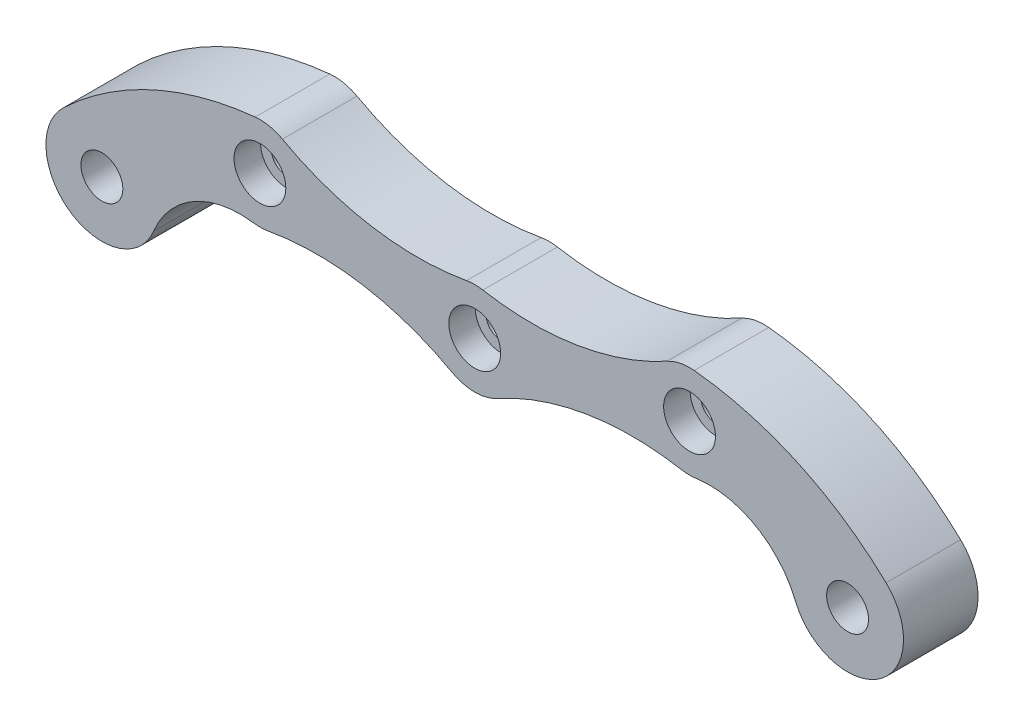
ISO-10303-21;
HEADER;
FILE_DESCRIPTION(('STEP AP214'),'2;1');
FILE_NAME('part.step','',(''),(''),'','','');
FILE_SCHEMA(('AUTOMOTIVE_DESIGN { 1 0 10303 214 1 1 1 1 }'));
ENDSEC;
DATA;
#1=APPLICATION_CONTEXT('core data for automotive mechanical design processes');
#2=APPLICATION_PROTOCOL_DEFINITION('international standard','automotive_design',2000,#1);
#3=PRODUCT_CONTEXT('',#1,'mechanical');
#4=PRODUCT('Part','Part','',(#3));
#5=PRODUCT_RELATED_PRODUCT_CATEGORY('part','',(#4));
#6=PRODUCT_DEFINITION_FORMATION('','',#4);
#7=PRODUCT_DEFINITION_CONTEXT('part definition',#1,'design');
#8=PRODUCT_DEFINITION('design','',#6,#7);
#9=PRODUCT_DEFINITION_SHAPE('','',#8);
#10=(LENGTH_UNIT() NAMED_UNIT(*) SI_UNIT(.MILLI.,.METRE.));
#11=(NAMED_UNIT(*) PLANE_ANGLE_UNIT() SI_UNIT($,.RADIAN.));
#12=(NAMED_UNIT(*) SI_UNIT($,.STERADIAN.) SOLID_ANGLE_UNIT());
#13=UNCERTAINTY_MEASURE_WITH_UNIT(LENGTH_MEASURE(1.E-05),#10,'distance_accuracy_value','');
#14=(GEOMETRIC_REPRESENTATION_CONTEXT(3) GLOBAL_UNCERTAINTY_ASSIGNED_CONTEXT((#13)) GLOBAL_UNIT_ASSIGNED_CONTEXT((#10,
#11,#12)) REPRESENTATION_CONTEXT('',''));
#15=CARTESIAN_POINT('',(0.,0.,0.));
#16=DIRECTION('',(0.,0.,1.));
#17=DIRECTION('',(1.,0.,0.));
#18=AXIS2_PLACEMENT_3D('',#15,#16,#17);
#19=CARTESIAN_POINT('',(-20.0412940888067,-26.0392504227336,4.));
#20=DIRECTION('',(0.,0.,-1.));
#21=DIRECTION('',(-1.,0.,0.));
#22=AXIS2_PLACEMENT_3D('',#19,#20,#21);
#23=CYLINDRICAL_SURFACE('',#22,35.);
#24=CARTESIAN_POINT('',(-20.0412940888067,-26.0392504227336,-4.));
#25=DIRECTION('',(0.,0.,1.));
#26=DIRECTION('',(-1.,0.,0.));
#27=AXIS2_PLACEMENT_3D('',#24,#25,#26);
#28=CIRCLE('',#27,35.);
#29=CARTESIAN_POINT('',(-23.5456176518656,8.78487507045559,-4.));
#30=VERTEX_POINT('',#29);
#31=CARTESIAN_POINT('',(-44.1293874299021,-0.647051636675808,-4.));
#32=VERTEX_POINT('',#31);
#33=EDGE_CURVE('E196',#30,#32,#28,.T.);
#34=ORIENTED_EDGE('',*,*,#33,.T.);
#35=DIRECTION('',(0.,0.,-1.));
#36=VECTOR('',#35,1.);
#37=CARTESIAN_POINT('',(-44.1293874299021,-0.647051636675808,4.));
#38=LINE('',#37,#36);
#39=CARTESIAN_POINT('',(-44.1293874299021,-0.647051636675808,4.));
#40=VERTEX_POINT('',#39);
#41=EDGE_CURVE('E11',#40,#32,#38,.T.);
#42=ORIENTED_EDGE('',*,*,#41,.F.);
#43=CARTESIAN_POINT('',(-20.0412940888067,-26.0392504227336,4.));
#44=DIRECTION('',(0.,0.,1.));
#45=DIRECTION('',(-1.,0.,0.));
#46=AXIS2_PLACEMENT_3D('',#43,#44,#45);
#47=CIRCLE('',#46,35.);
#48=CARTESIAN_POINT('',(-23.5456176518656,8.78487507045559,4.));
#49=VERTEX_POINT('',#48);
#50=EDGE_CURVE('E243',#49,#40,#47,.T.);
#51=ORIENTED_EDGE('',*,*,#50,.F.);
#52=DIRECTION('',(0.,0.,-1.));
#53=VECTOR('',#52,1.);
#54=CARTESIAN_POINT('',(-23.5456176518656,8.78487507045559,4.));
#55=LINE('',#54,#53);
#56=EDGE_CURVE('E192',#49,#30,#55,.T.);
#57=ORIENTED_EDGE('',*,*,#56,.T.);
#58=EDGE_LOOP('',(#34,#42,#51,#57));
#59=FACE_BOUND('',#58,.T.);
#60=ADVANCED_FACE('F45',(#59),#23,.T.);
#61=CARTESIAN_POINT('',(-40.,-5.,4.));
#62=DIRECTION('',(0.,0.,-1.));
#63=DIRECTION('',(-1.,0.,0.));
#64=AXIS2_PLACEMENT_3D('',#61,#62,#63);
#65=CYLINDRICAL_SURFACE('',#64,5.99999999999999);
#66=CARTESIAN_POINT('',(-40.,-5.,-4.));
#67=DIRECTION('',(0.,0.,1.));
#68=DIRECTION('',(1.,0.,0.));
#69=AXIS2_PLACEMENT_3D('',#66,#67,#68);
#70=CIRCLE('',#69,5.99999999999999);
#71=CARTESIAN_POINT('',(-34.4434701772464,-7.26384105644581,-4.));
#72=VERTEX_POINT('',#71);
#73=EDGE_CURVE('E200',#32,#72,#70,.T.);
#74=ORIENTED_EDGE('',*,*,#73,.T.);
#75=DIRECTION('',(0.,0.,-1.));
#76=VECTOR('',#75,1.);
#77=CARTESIAN_POINT('',(-34.4434701772464,-7.26384105644581,4.));
#78=LINE('',#77,#76);
#79=CARTESIAN_POINT('',(-34.4434701772464,-7.26384105644581,4.));
#80=VERTEX_POINT('',#79);
#81=EDGE_CURVE('E55',#80,#72,#78,.T.);
#82=ORIENTED_EDGE('',*,*,#81,.F.);
#83=CARTESIAN_POINT('',(-40.,-5.,4.));
#84=DIRECTION('',(0.,0.,1.));
#85=DIRECTION('',(1.,0.,0.));
#86=AXIS2_PLACEMENT_3D('',#83,#84,#85);
#87=CIRCLE('',#86,5.99999999999999);
#88=EDGE_CURVE('E131',#40,#80,#87,.T.);
#89=ORIENTED_EDGE('',*,*,#88,.F.);
#90=ORIENTED_EDGE('',*,*,#41,.T.);
#91=EDGE_LOOP('',(#74,#82,#89,#90));
#92=FACE_BOUND('',#91,.T.);
#93=ADVANCED_FACE('F421',(#92),#65,.T.);
#94=CARTESIAN_POINT('',(-25.1825871393237,-11.0369094838555,4.));
#95=DIRECTION('',(0.,0.,-1.));
#96=DIRECTION('',(-1.,0.,0.));
#97=AXIS2_PLACEMENT_3D('',#94,#95,#96);
#98=CYLINDRICAL_SURFACE('',#97,10.);
#99=CARTESIAN_POINT('',(-25.1825871393237,-11.0369094838555,-4.));
#100=DIRECTION('',(0.,0.,-1.));
#101=DIRECTION('',(-1.,0.,0.));
#102=AXIS2_PLACEMENT_3D('',#99,#100,#101);
#103=CIRCLE('',#102,10.);
#104=CARTESIAN_POINT('',(-23.7575290464412,-1.13896982795183,-4.));
#105=VERTEX_POINT('',#104);
#106=EDGE_CURVE('E204',#72,#105,#103,.T.);
#107=ORIENTED_EDGE('',*,*,#106,.T.);
#108=DIRECTION('',(0.,0.,-1.));
#109=VECTOR('',#108,1.);
#110=CARTESIAN_POINT('',(-23.7575290464412,-1.13896982795183,4.));
#111=LINE('',#110,#109);
#112=CARTESIAN_POINT('',(-23.7575290464412,-1.13896982795183,4.));
#113=VERTEX_POINT('',#112);
#114=EDGE_CURVE('E286',#113,#105,#111,.T.);
#115=ORIENTED_EDGE('',*,*,#114,.F.);
#116=CARTESIAN_POINT('',(-25.1825871393237,-11.0369094838555,4.));
#117=DIRECTION('',(0.,0.,-1.));
#118=DIRECTION('',(-1.,0.,0.));
#119=AXIS2_PLACEMENT_3D('',#116,#117,#118);
#120=CIRCLE('',#119,10.);
#121=EDGE_CURVE('E361',#80,#113,#120,.T.);
#122=ORIENTED_EDGE('',*,*,#121,.F.);
#123=ORIENTED_EDGE('',*,*,#81,.T.);
#124=EDGE_LOOP('',(#107,#115,#122,#123));
#125=FACE_BOUND('',#124,.T.);
#126=ADVANCED_FACE('F425',(#125),#98,.F.);
#127=CARTESIAN_POINT('',(-23.045,3.81,4.));
#128=DIRECTION('',(0.,0.,-1.));
#129=DIRECTION('',(-1.,0.,0.));
#130=AXIS2_PLACEMENT_3D('',#127,#128,#129);
#131=CYLINDRICAL_SURFACE('',#130,5.00000000000001);
#132=CARTESIAN_POINT('',(-23.045,3.81,-4.));
#133=DIRECTION('',(0.,0.,1.));
#134=DIRECTION('',(1.,0.,0.));
#135=AXIS2_PLACEMENT_3D('',#132,#133,#134);
#136=CIRCLE('',#135,5.00000000000001);
#137=CARTESIAN_POINT('',(-22.1677566541599,-1.11244290085516,-4.));
#138=VERTEX_POINT('',#137);
#139=EDGE_CURVE('E207',#105,#138,#136,.T.);
#140=ORIENTED_EDGE('',*,*,#139,.T.);
#141=DIRECTION('',(0.,0.,-1.));
#142=VECTOR('',#141,1.);
#143=CARTESIAN_POINT('',(-22.1677566541599,-1.11244290085516,4.));
#144=LINE('',#143,#142);
#145=CARTESIAN_POINT('',(-22.1677566541599,-1.11244290085516,4.));
#146=VERTEX_POINT('',#145);
#147=EDGE_CURVE('E282',#146,#138,#144,.T.);
#148=ORIENTED_EDGE('',*,*,#147,.F.);
#149=CARTESIAN_POINT('',(-23.045,3.81,4.));
#150=DIRECTION('',(0.,0.,1.));
#151=DIRECTION('',(1.,0.,0.));
#152=AXIS2_PLACEMENT_3D('',#149,#150,#151);
#153=CIRCLE('',#152,5.00000000000001);
#154=EDGE_CURVE('E364',#113,#146,#153,.T.);
#155=ORIENTED_EDGE('',*,*,#154,.F.);
#156=ORIENTED_EDGE('',*,*,#114,.T.);
#157=EDGE_LOOP('',(#140,#148,#155,#156));
#158=FACE_BOUND('',#157,.T.);
#159=ADVANCED_FACE('F429',(#158),#131,.T.);
#160=CARTESIAN_POINT('',(-16.9042965791194,-30.6471003059861,4.));
#161=DIRECTION('',(0.,0.,-1.));
#162=DIRECTION('',(-1.,0.,0.));
#163=AXIS2_PLACEMENT_3D('',#160,#161,#162);
#164=CYLINDRICAL_SURFACE('',#163,30.);
#165=CARTESIAN_POINT('',(-16.9042965791194,-30.6471003059861,-4.));
#166=DIRECTION('',(0.,0.,-1.));
#167=DIRECTION('',(-1.,0.,0.));
#168=AXIS2_PLACEMENT_3D('',#165,#166,#167);
#169=CIRCLE('',#168,30.);
#170=CARTESIAN_POINT('',(-2.41489951130277,-4.37815718656944,-4.));
#171=VERTEX_POINT('',#170);
#172=EDGE_CURVE('E210',#138,#171,#169,.T.);
#173=ORIENTED_EDGE('',*,*,#172,.T.);
#174=DIRECTION('',(0.,0.,-1.));
#175=VECTOR('',#174,1.);
#176=CARTESIAN_POINT('',(-2.41489951130277,-4.37815718656944,4.));
#177=LINE('',#176,#175);
#178=CARTESIAN_POINT('',(-2.41489951130277,-4.37815718656944,4.));
#179=VERTEX_POINT('',#178);
#180=EDGE_CURVE('E278',#179,#171,#177,.T.);
#181=ORIENTED_EDGE('',*,*,#180,.F.);
#182=CARTESIAN_POINT('',(-16.9042965791194,-30.6471003059861,4.));
#183=DIRECTION('',(0.,0.,-1.));
#184=DIRECTION('',(-1.,0.,0.));
#185=AXIS2_PLACEMENT_3D('',#182,#183,#184);
#186=CIRCLE('',#185,30.);
#187=EDGE_CURVE('E367',#146,#179,#186,.T.);
#188=ORIENTED_EDGE('',*,*,#187,.F.);
#189=ORIENTED_EDGE('',*,*,#147,.T.);
#190=EDGE_LOOP('',(#173,#181,#188,#189));
#191=FACE_BOUND('',#190,.T.);
#192=ADVANCED_FACE('F435',(#191),#164,.F.);
#193=CARTESIAN_POINT('',(0.,0.,4.));
#194=DIRECTION('',(0.,0.,-1.));
#195=DIRECTION('',(-1.,0.,0.));
#196=AXIS2_PLACEMENT_3D('',#193,#194,#195);
#197=CYLINDRICAL_SURFACE('',#196,5.);
#198=CARTESIAN_POINT('',(0.,0.,-4.));
#199=DIRECTION('',(0.,0.,1.));
#200=DIRECTION('',(1.,0.,0.));
#201=AXIS2_PLACEMENT_3D('',#198,#199,#200);
#202=CIRCLE('',#201,5.);
#203=CARTESIAN_POINT('',(2.41489951130277,-4.37815718656944,-4.));
#204=VERTEX_POINT('',#203);
#205=EDGE_CURVE('E213',#171,#204,#202,.T.);
#206=ORIENTED_EDGE('',*,*,#205,.T.);
#207=DIRECTION('',(0.,0.,-1.));
#208=VECTOR('',#207,1.);
#209=CARTESIAN_POINT('',(2.41489951130277,-4.37815718656944,4.));
#210=LINE('',#209,#208);
#211=CARTESIAN_POINT('',(2.41489951130277,-4.37815718656944,4.));
#212=VERTEX_POINT('',#211);
#213=EDGE_CURVE('E274',#212,#204,#210,.T.);
#214=ORIENTED_EDGE('',*,*,#213,.F.);
#215=CARTESIAN_POINT('',(0.,0.,4.));
#216=DIRECTION('',(0.,0.,1.));
#217=DIRECTION('',(1.,0.,0.));
#218=AXIS2_PLACEMENT_3D('',#215,#216,#217);
#219=CIRCLE('',#218,5.);
#220=EDGE_CURVE('E370',#179,#212,#219,.T.);
#221=ORIENTED_EDGE('',*,*,#220,.F.);
#222=ORIENTED_EDGE('',*,*,#180,.T.);
#223=EDGE_LOOP('',(#206,#214,#221,#222));
#224=FACE_BOUND('',#223,.T.);
#225=ADVANCED_FACE('F439',(#224),#197,.T.);
#226=CARTESIAN_POINT('',(16.9042965791194,-30.6471003059861,4.));
#227=DIRECTION('',(0.,0.,-1.));
#228=DIRECTION('',(-1.,0.,0.));
#229=AXIS2_PLACEMENT_3D('',#226,#227,#228);
#230=CYLINDRICAL_SURFACE('',#229,30.);
#231=CARTESIAN_POINT('',(16.9042965791194,-30.6471003059861,-4.));
#232=DIRECTION('',(0.,0.,-1.));
#233=DIRECTION('',(1.,0.,0.));
#234=AXIS2_PLACEMENT_3D('',#231,#232,#233);
#235=CIRCLE('',#234,30.);
#236=CARTESIAN_POINT('',(22.1677566541599,-1.11244290085516,-4.));
#237=VERTEX_POINT('',#236);
#238=EDGE_CURVE('E216',#204,#237,#235,.T.);
#239=ORIENTED_EDGE('',*,*,#238,.T.);
#240=DIRECTION('',(0.,0.,-1.));
#241=VECTOR('',#240,1.);
#242=CARTESIAN_POINT('',(22.1677566541599,-1.11244290085516,4.));
#243=LINE('',#242,#241);
#244=CARTESIAN_POINT('',(22.1677566541599,-1.11244290085516,4.));
#245=VERTEX_POINT('',#244);
#246=EDGE_CURVE('E270',#245,#237,#243,.T.);
#247=ORIENTED_EDGE('',*,*,#246,.F.);
#248=CARTESIAN_POINT('',(16.9042965791194,-30.6471003059861,4.));
#249=DIRECTION('',(0.,0.,-1.));
#250=DIRECTION('',(1.,0.,0.));
#251=AXIS2_PLACEMENT_3D('',#248,#249,#250);
#252=CIRCLE('',#251,30.);
#253=EDGE_CURVE('E373',#212,#245,#252,.T.);
#254=ORIENTED_EDGE('',*,*,#253,.F.);
#255=ORIENTED_EDGE('',*,*,#213,.T.);
#256=EDGE_LOOP('',(#239,#247,#254,#255));
#257=FACE_BOUND('',#256,.T.);
#258=ADVANCED_FACE('F443',(#257),#230,.F.);
#259=CARTESIAN_POINT('',(23.045,3.81,4.));
#260=DIRECTION('',(0.,0.,-1.));
#261=DIRECTION('',(-1.,0.,0.));
#262=AXIS2_PLACEMENT_3D('',#259,#260,#261);
#263=CYLINDRICAL_SURFACE('',#262,5.00000000000001);
#264=CARTESIAN_POINT('',(23.045,3.81,-4.));
#265=DIRECTION('',(0.,0.,1.));
#266=DIRECTION('',(1.,0.,0.));
#267=AXIS2_PLACEMENT_3D('',#264,#265,#266);
#268=CIRCLE('',#267,5.00000000000001);
#269=CARTESIAN_POINT('',(23.7575290464412,-1.13896982795183,-4.));
#270=VERTEX_POINT('',#269);
#271=EDGE_CURVE('E219',#237,#270,#268,.T.);
#272=ORIENTED_EDGE('',*,*,#271,.T.);
#273=DIRECTION('',(0.,0.,-1.));
#274=VECTOR('',#273,1.);
#275=CARTESIAN_POINT('',(23.7575290464412,-1.13896982795183,4.));
#276=LINE('',#275,#274);
#277=CARTESIAN_POINT('',(23.7575290464412,-1.13896982795183,4.));
#278=VERTEX_POINT('',#277);
#279=EDGE_CURVE('E266',#278,#270,#276,.T.);
#280=ORIENTED_EDGE('',*,*,#279,.F.);
#281=CARTESIAN_POINT('',(23.045,3.81,4.));
#282=DIRECTION('',(0.,0.,1.));
#283=DIRECTION('',(1.,0.,0.));
#284=AXIS2_PLACEMENT_3D('',#281,#282,#283);
#285=CIRCLE('',#284,5.00000000000001);
#286=EDGE_CURVE('E376',#245,#278,#285,.T.);
#287=ORIENTED_EDGE('',*,*,#286,.F.);
#288=ORIENTED_EDGE('',*,*,#246,.T.);
#289=EDGE_LOOP('',(#272,#280,#287,#288));
#290=FACE_BOUND('',#289,.T.);
#291=ADVANCED_FACE('F447',(#290),#263,.T.);
#292=CARTESIAN_POINT('',(25.1825871393237,-11.0369094838555,4.));
#293=DIRECTION('',(0.,0.,-1.));
#294=DIRECTION('',(-1.,0.,0.));
#295=AXIS2_PLACEMENT_3D('',#292,#293,#294);
#296=CYLINDRICAL_SURFACE('',#295,10.);
#297=CARTESIAN_POINT('',(25.1825871393237,-11.0369094838555,-4.));
#298=DIRECTION('',(0.,0.,-1.));
#299=DIRECTION('',(1.,0.,0.));
#300=AXIS2_PLACEMENT_3D('',#297,#298,#299);
#301=CIRCLE('',#300,10.);
#302=CARTESIAN_POINT('',(34.4434701772464,-7.26384105644581,-4.));
#303=VERTEX_POINT('',#302);
#304=EDGE_CURVE('E222',#270,#303,#301,.T.);
#305=ORIENTED_EDGE('',*,*,#304,.T.);
#306=DIRECTION('',(0.,0.,-1.));
#307=VECTOR('',#306,1.);
#308=CARTESIAN_POINT('',(34.4434701772464,-7.26384105644581,4.));
#309=LINE('',#308,#307);
#310=CARTESIAN_POINT('',(34.4434701772464,-7.26384105644581,4.));
#311=VERTEX_POINT('',#310);
#312=EDGE_CURVE('E262',#311,#303,#309,.T.);
#313=ORIENTED_EDGE('',*,*,#312,.F.);
#314=CARTESIAN_POINT('',(25.1825871393237,-11.0369094838555,4.));
#315=DIRECTION('',(0.,0.,-1.));
#316=DIRECTION('',(1.,0.,0.));
#317=AXIS2_PLACEMENT_3D('',#314,#315,#316);
#318=CIRCLE('',#317,10.);
#319=EDGE_CURVE('E379',#278,#311,#318,.T.);
#320=ORIENTED_EDGE('',*,*,#319,.F.);
#321=ORIENTED_EDGE('',*,*,#279,.T.);
#322=EDGE_LOOP('',(#305,#313,#320,#321));
#323=FACE_BOUND('',#322,.T.);
#324=ADVANCED_FACE('F451',(#323),#296,.F.);
#325=CARTESIAN_POINT('',(40.,-4.99999999999999,4.));
#326=DIRECTION('',(0.,0.,-1.));
#327=DIRECTION('',(-1.,0.,0.));
#328=AXIS2_PLACEMENT_3D('',#325,#326,#327);
#329=CYLINDRICAL_SURFACE('',#328,5.99999999999999);
#330=CARTESIAN_POINT('',(40.,-4.99999999999999,-4.));
#331=DIRECTION('',(0.,0.,1.));
#332=DIRECTION('',(1.,0.,0.));
#333=AXIS2_PLACEMENT_3D('',#330,#331,#332);
#334=CIRCLE('',#333,5.99999999999999);
#335=CARTESIAN_POINT('',(44.1293874299021,-0.647051636675806,-4.));
#336=VERTEX_POINT('',#335);
#337=EDGE_CURVE('E225',#303,#336,#334,.T.);
#338=ORIENTED_EDGE('',*,*,#337,.T.);
#339=DIRECTION('',(0.,0.,-1.));
#340=VECTOR('',#339,1.);
#341=CARTESIAN_POINT('',(44.1293874299021,-0.647051636675806,4.));
#342=LINE('',#341,#340);
#343=CARTESIAN_POINT('',(44.1293874299021,-0.647051636675806,4.));
#344=VERTEX_POINT('',#343);
#345=EDGE_CURVE('E258',#344,#336,#342,.T.);
#346=ORIENTED_EDGE('',*,*,#345,.F.);
#347=CARTESIAN_POINT('',(40.,-4.99999999999999,4.));
#348=DIRECTION('',(0.,0.,1.));
#349=DIRECTION('',(1.,0.,0.));
#350=AXIS2_PLACEMENT_3D('',#347,#348,#349);
#351=CIRCLE('',#350,5.99999999999999);
#352=EDGE_CURVE('E382',#311,#344,#351,.T.);
#353=ORIENTED_EDGE('',*,*,#352,.F.);
#354=ORIENTED_EDGE('',*,*,#312,.T.);
#355=EDGE_LOOP('',(#338,#346,#353,#354));
#356=FACE_BOUND('',#355,.T.);
#357=ADVANCED_FACE('F455',(#356),#329,.T.);
#358=CARTESIAN_POINT('',(20.0412940888067,-26.0392504227336,4.));
#359=DIRECTION('',(0.,0.,-1.));
#360=DIRECTION('',(-1.,0.,0.));
#361=AXIS2_PLACEMENT_3D('',#358,#359,#360);
#362=CYLINDRICAL_SURFACE('',#361,35.);
#363=CARTESIAN_POINT('',(20.0412940888067,-26.0392504227336,-4.));
#364=DIRECTION('',(0.,0.,1.));
#365=DIRECTION('',(1.,0.,0.));
#366=AXIS2_PLACEMENT_3D('',#363,#364,#365);
#367=CIRCLE('',#366,35.);
#368=CARTESIAN_POINT('',(23.5456176518656,8.78487507045559,-4.));
#369=VERTEX_POINT('',#368);
#370=EDGE_CURVE('E228',#336,#369,#367,.T.);
#371=ORIENTED_EDGE('',*,*,#370,.T.);
#372=DIRECTION('',(0.,0.,-1.));
#373=VECTOR('',#372,1.);
#374=CARTESIAN_POINT('',(23.5456176518656,8.78487507045559,4.));
#375=LINE('',#374,#373);
#376=CARTESIAN_POINT('',(23.5456176518656,8.78487507045559,4.));
#377=VERTEX_POINT('',#376);
#378=EDGE_CURVE('E254',#377,#369,#375,.T.);
#379=ORIENTED_EDGE('',*,*,#378,.F.);
#380=CARTESIAN_POINT('',(20.0412940888067,-26.0392504227336,4.));
#381=DIRECTION('',(0.,0.,1.));
#382=DIRECTION('',(1.,0.,0.));
#383=AXIS2_PLACEMENT_3D('',#380,#381,#382);
#384=CIRCLE('',#383,35.);
#385=EDGE_CURVE('E385',#344,#377,#384,.T.);
#386=ORIENTED_EDGE('',*,*,#385,.F.);
#387=ORIENTED_EDGE('',*,*,#345,.T.);
#388=EDGE_LOOP('',(#371,#379,#386,#387));
#389=FACE_BOUND('',#388,.T.);
#390=ADVANCED_FACE('F459',(#389),#362,.T.);
#391=CARTESIAN_POINT('',(23.045,3.81,4.));
#392=DIRECTION('',(0.,0.,-1.));
#393=DIRECTION('',(-1.,0.,0.));
#394=AXIS2_PLACEMENT_3D('',#391,#392,#393);
#395=CYLINDRICAL_SURFACE('',#394,4.99999999999999);
#396=CARTESIAN_POINT('',(23.045,3.81,-4.));
#397=DIRECTION('',(0.,0.,1.));
#398=DIRECTION('',(1.,0.,0.));
#399=AXIS2_PLACEMENT_3D('',#396,#397,#398);
#400=CIRCLE('',#399,4.99999999999999);
#401=CARTESIAN_POINT('',(20.6301004886972,8.18815718656943,-4.));
#402=VERTEX_POINT('',#401);
#403=EDGE_CURVE('E231',#369,#402,#400,.T.);
#404=ORIENTED_EDGE('',*,*,#403,.T.);
#405=DIRECTION('',(0.,0.,-1.));
#406=VECTOR('',#405,1.);
#407=CARTESIAN_POINT('',(20.6301004886972,8.18815718656943,4.));
#408=LINE('',#407,#406);
#409=CARTESIAN_POINT('',(20.6301004886972,8.18815718656943,4.));
#410=VERTEX_POINT('',#409);
#411=EDGE_CURVE('E250',#410,#402,#408,.T.);
#412=ORIENTED_EDGE('',*,*,#411,.F.);
#413=CARTESIAN_POINT('',(23.045,3.81,4.));
#414=DIRECTION('',(0.,0.,1.));
#415=DIRECTION('',(1.,0.,0.));
#416=AXIS2_PLACEMENT_3D('',#413,#414,#415);
#417=CIRCLE('',#416,4.99999999999999);
#418=EDGE_CURVE('E388',#377,#410,#417,.T.);
#419=ORIENTED_EDGE('',*,*,#418,.F.);
#420=ORIENTED_EDGE('',*,*,#378,.T.);
#421=EDGE_LOOP('',(#404,#412,#419,#420));
#422=FACE_BOUND('',#421,.T.);
#423=ADVANCED_FACE('F396',(#422),#395,.T.);
#424=CARTESIAN_POINT('',(6.14070342088059,34.4571003059861,4.));
#425=DIRECTION('',(0.,0.,-1.));
#426=DIRECTION('',(-1.,0.,0.));
#427=AXIS2_PLACEMENT_3D('',#424,#425,#426);
#428=CYLINDRICAL_SURFACE('',#427,30.);
#429=CARTESIAN_POINT('',(6.14070342088059,34.4571003059861,-4.));
#430=DIRECTION('',(0.,0.,-1.));
#431=DIRECTION('',(1.,0.,0.));
#432=AXIS2_PLACEMENT_3D('',#429,#430,#431);
#433=CIRCLE('',#432,30.);
#434=CARTESIAN_POINT('',(0.877243345840085,4.92244290085516,-4.));
#435=VERTEX_POINT('',#434);
#436=EDGE_CURVE('E234',#402,#435,#433,.T.);
#437=ORIENTED_EDGE('',*,*,#436,.T.);
#438=DIRECTION('',(0.,0.,-1.));
#439=VECTOR('',#438,1.);
#440=CARTESIAN_POINT('',(0.877243345840085,4.92244290085516,4.));
#441=LINE('',#440,#439);
#442=CARTESIAN_POINT('',(0.877243345840085,4.92244290085516,4.));
#443=VERTEX_POINT('',#442);
#444=EDGE_CURVE('E185',#443,#435,#441,.T.);
#445=ORIENTED_EDGE('',*,*,#444,.F.);
#446=CARTESIAN_POINT('',(6.14070342088059,34.4571003059861,4.));
#447=DIRECTION('',(0.,0.,-1.));
#448=DIRECTION('',(1.,0.,0.));
#449=AXIS2_PLACEMENT_3D('',#446,#447,#448);
#450=CIRCLE('',#449,30.);
#451=EDGE_CURVE('E174',#410,#443,#450,.T.);
#452=ORIENTED_EDGE('',*,*,#451,.F.);
#453=ORIENTED_EDGE('',*,*,#411,.T.);
#454=EDGE_LOOP('',(#437,#445,#452,#453));
#455=FACE_BOUND('',#454,.T.);
#456=ADVANCED_FACE('F400',(#455),#428,.F.);
#457=CARTESIAN_POINT('',(0.,0.,4.));
#458=DIRECTION('',(0.,0.,-1.));
#459=DIRECTION('',(-1.,0.,0.));
#460=AXIS2_PLACEMENT_3D('',#457,#458,#459);
#461=CYLINDRICAL_SURFACE('',#460,5.);
#462=CARTESIAN_POINT('',(0.,0.,-4.));
#463=DIRECTION('',(0.,0.,1.));
#464=DIRECTION('',(1.,0.,0.));
#465=AXIS2_PLACEMENT_3D('',#462,#463,#464);
#466=CIRCLE('',#465,5.);
#467=CARTESIAN_POINT('',(-0.877243345840084,4.92244290085515,-4.));
#468=VERTEX_POINT('',#467);
#469=EDGE_CURVE('E183',#435,#468,#466,.T.);
#470=ORIENTED_EDGE('',*,*,#469,.T.);
#471=DIRECTION('',(0.,0.,-1.));
#472=VECTOR('',#471,1.);
#473=CARTESIAN_POINT('',(-0.877243345840084,4.92244290085515,4.));
#474=LINE('',#473,#472);
#475=CARTESIAN_POINT('',(-0.877243345840084,4.92244290085515,4.));
#476=VERTEX_POINT('',#475);
#477=EDGE_CURVE('E180',#476,#468,#474,.T.);
#478=ORIENTED_EDGE('',*,*,#477,.F.);
#479=CARTESIAN_POINT('',(0.,0.,4.));
#480=DIRECTION('',(0.,0.,1.));
#481=DIRECTION('',(1.,0.,0.));
#482=AXIS2_PLACEMENT_3D('',#479,#480,#481);
#483=CIRCLE('',#482,5.);
#484=EDGE_CURVE('E168',#443,#476,#483,.T.);
#485=ORIENTED_EDGE('',*,*,#484,.F.);
#486=ORIENTED_EDGE('',*,*,#444,.T.);
#487=EDGE_LOOP('',(#470,#478,#485,#486));
#488=FACE_BOUND('',#487,.T.);
#489=ADVANCED_FACE('F181',(#488),#461,.T.);
#490=CARTESIAN_POINT('',(-6.14070342088059,34.4571003059861,4.));
#491=DIRECTION('',(0.,0.,-1.));
#492=DIRECTION('',(-1.,0.,0.));
#493=AXIS2_PLACEMENT_3D('',#490,#491,#492);
#494=CYLINDRICAL_SURFACE('',#493,30.);
#495=CARTESIAN_POINT('',(-6.14070342088059,34.4571003059861,-4.));
#496=DIRECTION('',(0.,0.,-1.));
#497=DIRECTION('',(-1.,0.,0.));
#498=AXIS2_PLACEMENT_3D('',#495,#496,#497);
#499=CIRCLE('',#498,30.);
#500=CARTESIAN_POINT('',(-20.6301004886972,8.18815718656944,-4.));
#501=VERTEX_POINT('',#500);
#502=EDGE_CURVE('E117',#468,#501,#499,.T.);
#503=ORIENTED_EDGE('',*,*,#502,.T.);
#504=DIRECTION('',(0.,0.,-1.));
#505=VECTOR('',#504,1.);
#506=CARTESIAN_POINT('',(-20.6301004886972,8.18815718656944,4.));
#507=LINE('',#506,#505);
#508=CARTESIAN_POINT('',(-20.6301004886972,8.18815718656944,4.));
#509=VERTEX_POINT('',#508);
#510=EDGE_CURVE('E186',#509,#501,#507,.T.);
#511=ORIENTED_EDGE('',*,*,#510,.F.);
#512=CARTESIAN_POINT('',(-6.14070342088059,34.4571003059861,4.));
#513=DIRECTION('',(0.,0.,-1.));
#514=DIRECTION('',(-1.,0.,0.));
#515=AXIS2_PLACEMENT_3D('',#512,#513,#514);
#516=CIRCLE('',#515,30.);
#517=EDGE_CURVE('E172',#476,#509,#516,.T.);
#518=ORIENTED_EDGE('',*,*,#517,.F.);
#519=ORIENTED_EDGE('',*,*,#477,.T.);
#520=EDGE_LOOP('',(#503,#511,#518,#519));
#521=FACE_BOUND('',#520,.T.);
#522=ADVANCED_FACE('F188',(#521),#494,.F.);
#523=CARTESIAN_POINT('',(-23.045,3.81,4.));
#524=DIRECTION('',(0.,0.,-1.));
#525=DIRECTION('',(-1.,0.,0.));
#526=AXIS2_PLACEMENT_3D('',#523,#524,#525);
#527=CYLINDRICAL_SURFACE('',#526,4.99999999999999);
#528=CARTESIAN_POINT('',(-23.045,3.81,-4.));
#529=DIRECTION('',(0.,0.,1.));
#530=DIRECTION('',(1.,0.,0.));
#531=AXIS2_PLACEMENT_3D('',#528,#529,#530);
#532=CIRCLE('',#531,4.99999999999999);
#533=EDGE_CURVE('E123',#501,#30,#532,.T.);
#534=ORIENTED_EDGE('',*,*,#533,.T.);
#535=ORIENTED_EDGE('',*,*,#56,.F.);
#536=CARTESIAN_POINT('',(-23.045,3.81,4.));
#537=DIRECTION('',(0.,0.,1.));
#538=DIRECTION('',(1.,0.,0.));
#539=AXIS2_PLACEMENT_3D('',#536,#537,#538);
#540=CIRCLE('',#539,4.99999999999999);
#541=EDGE_CURVE('E64',#509,#49,#540,.T.);
#542=ORIENTED_EDGE('',*,*,#541,.F.);
#543=ORIENTED_EDGE('',*,*,#510,.T.);
#544=EDGE_LOOP('',(#534,#535,#542,#543));
#545=FACE_BOUND('',#544,.T.);
#546=ADVANCED_FACE('F408',(#545),#527,.T.);
#547=CARTESIAN_POINT('',(-21.5431470444033,-11.1146252113668,4.));
#548=DIRECTION('',(0.,0.,-1.));
#549=DIRECTION('',(-1.,0.,0.));
#550=AXIS2_PLACEMENT_3D('',#547,#548,#549);
#551=PLANE('',#550);
#552=CARTESIAN_POINT('',(40.,-4.99999999999999,4.));
#553=DIRECTION('',(0.,0.,-1.));
#554=DIRECTION('',(-1.,0.,0.));
#555=AXIS2_PLACEMENT_3D('',#552,#553,#554);
#556=CIRCLE('',#555,2.2479);
#557=CARTESIAN_POINT('',(37.7521,-4.99999999999999,4.));
#558=VERTEX_POINT('',#557);
#559=EDGE_CURVE('E48',#558,#558,#556,.T.);
#560=ORIENTED_EDGE('',*,*,#559,.T.);
#561=EDGE_LOOP('',(#560));
#562=FACE_BOUND('',#561,.T.);
#563=CARTESIAN_POINT('',(-40.,-5.,4.));
#564=DIRECTION('',(0.,0.,-1.));
#565=DIRECTION('',(-1.,0.,0.));
#566=AXIS2_PLACEMENT_3D('',#563,#564,#565);
#567=CIRCLE('',#566,2.2479);
#568=CARTESIAN_POINT('',(-42.2479,-5.,4.));
#569=VERTEX_POINT('',#568);
#570=EDGE_CURVE('E308',#569,#569,#567,.T.);
#571=ORIENTED_EDGE('',*,*,#570,.T.);
#572=EDGE_LOOP('',(#571));
#573=FACE_BOUND('',#572,.T.);
#574=CARTESIAN_POINT('',(-23.045,3.81,4.));
#575=DIRECTION('',(0.,0.,1.));
#576=DIRECTION('',(1.,0.,0.));
#577=AXIS2_PLACEMENT_3D('',#574,#575,#576);
#578=CIRCLE('',#577,2.77876);
#579=CARTESIAN_POINT('',(-20.26624,3.81,4.));
#580=VERTEX_POINT('',#579);
#581=EDGE_CURVE('E311',#580,#580,#578,.T.);
#582=ORIENTED_EDGE('',*,*,#581,.F.);
#583=EDGE_LOOP('',(#582));
#584=FACE_BOUND('',#583,.T.);
#585=CARTESIAN_POINT('',(0.,0.,4.));
#586=DIRECTION('',(0.,0.,1.));
#587=DIRECTION('',(1.,0.,0.));
#588=AXIS2_PLACEMENT_3D('',#585,#586,#587);
#589=CIRCLE('',#588,2.77876);
#590=CARTESIAN_POINT('',(2.77876,0.,4.));
#591=VERTEX_POINT('',#590);
#592=EDGE_CURVE('E306',#591,#591,#589,.T.);
#593=ORIENTED_EDGE('',*,*,#592,.F.);
#594=EDGE_LOOP('',(#593));
#595=FACE_BOUND('',#594,.T.);
#596=CARTESIAN_POINT('',(23.045,3.81,4.));
#597=DIRECTION('',(0.,0.,1.));
#598=DIRECTION('',(1.,0.,0.));
#599=AXIS2_PLACEMENT_3D('',#596,#597,#598);
#600=CIRCLE('',#599,2.77876);
#601=CARTESIAN_POINT('',(25.82376,3.81,4.));
#602=VERTEX_POINT('',#601);
#603=EDGE_CURVE('E301',#602,#602,#600,.T.);
#604=ORIENTED_EDGE('',*,*,#603,.F.);
#605=EDGE_LOOP('',(#604));
#606=FACE_BOUND('',#605,.T.);
#607=ORIENTED_EDGE('',*,*,#50,.T.);
#608=ORIENTED_EDGE('',*,*,#88,.T.);
#609=ORIENTED_EDGE('',*,*,#121,.T.);
#610=ORIENTED_EDGE('',*,*,#154,.T.);
#611=ORIENTED_EDGE('',*,*,#187,.T.);
#612=ORIENTED_EDGE('',*,*,#220,.T.);
#613=ORIENTED_EDGE('',*,*,#253,.T.);
#614=ORIENTED_EDGE('',*,*,#286,.T.);
#615=ORIENTED_EDGE('',*,*,#319,.T.);
#616=ORIENTED_EDGE('',*,*,#352,.T.);
#617=ORIENTED_EDGE('',*,*,#385,.T.);
#618=ORIENTED_EDGE('',*,*,#418,.T.);
#619=ORIENTED_EDGE('',*,*,#451,.T.);
#620=ORIENTED_EDGE('',*,*,#484,.T.);
#621=ORIENTED_EDGE('',*,*,#517,.T.);
#622=ORIENTED_EDGE('',*,*,#541,.T.);
#623=EDGE_LOOP('',(#607,#608,#609,#610,#611,#612,#613,#614,#615,#616,#617,#618,#619,#620,#621,#622));
#624=FACE_BOUND('',#623,.T.);
#625=ADVANCED_FACE('F170',(#562,#573,#584,#595,#606,#624),#551,.F.);
#626=CARTESIAN_POINT('',(-21.5431470444033,-11.1146252113668,-4.));
#627=DIRECTION('',(0.,0.,-1.));
#628=DIRECTION('',(-1.,0.,0.));
#629=AXIS2_PLACEMENT_3D('',#626,#627,#628);
#630=PLANE('',#629);
#631=CARTESIAN_POINT('',(40.,-4.99999999999999,-4.));
#632=DIRECTION('',(0.,0.,-1.));
#633=DIRECTION('',(-1.,0.,0.));
#634=AXIS2_PLACEMENT_3D('',#631,#632,#633);
#635=CIRCLE('',#634,3.96875);
#636=CARTESIAN_POINT('',(36.03125,-4.99999999999999,-4.));
#637=VERTEX_POINT('',#636);
#638=EDGE_CURVE('E654',#637,#637,#635,.T.);
#639=ORIENTED_EDGE('',*,*,#638,.F.);
#640=EDGE_LOOP('',(#639));
#641=FACE_BOUND('',#640,.T.);
#642=CARTESIAN_POINT('',(-40.,-5.,-4.));
#643=DIRECTION('',(0.,0.,-1.));
#644=DIRECTION('',(-1.,0.,0.));
#645=AXIS2_PLACEMENT_3D('',#642,#643,#644);
#646=CIRCLE('',#645,3.96875);
#647=CARTESIAN_POINT('',(-43.96875,-5.,-4.));
#648=VERTEX_POINT('',#647);
#649=EDGE_CURVE('E327',#648,#648,#646,.T.);
#650=ORIENTED_EDGE('',*,*,#649,.F.);
#651=EDGE_LOOP('',(#650));
#652=FACE_BOUND('',#651,.T.);
#653=CARTESIAN_POINT('',(-23.045,3.81,-4.));
#654=DIRECTION('',(0.,0.,-1.));
#655=DIRECTION('',(-1.,0.,0.));
#656=AXIS2_PLACEMENT_3D('',#653,#654,#655);
#657=CIRCLE('',#656,1.63195);
#658=CARTESIAN_POINT('',(-24.67695,3.81,-4.));
#659=VERTEX_POINT('',#658);
#660=EDGE_CURVE('E303',#659,#659,#657,.T.);
#661=ORIENTED_EDGE('',*,*,#660,.F.);
#662=EDGE_LOOP('',(#661));
#663=FACE_BOUND('',#662,.T.);
#664=CARTESIAN_POINT('',(0.,0.,-4.));
#665=DIRECTION('',(0.,0.,-1.));
#666=DIRECTION('',(-1.,0.,0.));
#667=AXIS2_PLACEMENT_3D('',#664,#665,#666);
#668=CIRCLE('',#667,1.63195);
#669=CARTESIAN_POINT('',(-1.63195,0.,-4.));
#670=VERTEX_POINT('',#669);
#671=EDGE_CURVE('E297',#670,#670,#668,.T.);
#672=ORIENTED_EDGE('',*,*,#671,.F.);
#673=EDGE_LOOP('',(#672));
#674=FACE_BOUND('',#673,.T.);
#675=CARTESIAN_POINT('',(23.045,3.81,-4.));
#676=DIRECTION('',(0.,0.,-1.));
#677=DIRECTION('',(-1.,0.,0.));
#678=AXIS2_PLACEMENT_3D('',#675,#676,#677);
#679=CIRCLE('',#678,1.63195);
#680=CARTESIAN_POINT('',(21.41305,3.81,-4.));
#681=VERTEX_POINT('',#680);
#682=EDGE_CURVE('E201',#681,#681,#679,.T.);
#683=ORIENTED_EDGE('',*,*,#682,.F.);
#684=EDGE_LOOP('',(#683));
#685=FACE_BOUND('',#684,.T.);
#686=ORIENTED_EDGE('',*,*,#33,.F.);
#687=ORIENTED_EDGE('',*,*,#533,.F.);
#688=ORIENTED_EDGE('',*,*,#502,.F.);
#689=ORIENTED_EDGE('',*,*,#469,.F.);
#690=ORIENTED_EDGE('',*,*,#436,.F.);
#691=ORIENTED_EDGE('',*,*,#403,.F.);
#692=ORIENTED_EDGE('',*,*,#370,.F.);
#693=ORIENTED_EDGE('',*,*,#337,.F.);
#694=ORIENTED_EDGE('',*,*,#304,.F.);
#695=ORIENTED_EDGE('',*,*,#271,.F.);
#696=ORIENTED_EDGE('',*,*,#238,.F.);
#697=ORIENTED_EDGE('',*,*,#205,.F.);
#698=ORIENTED_EDGE('',*,*,#172,.F.);
#699=ORIENTED_EDGE('',*,*,#139,.F.);
#700=ORIENTED_EDGE('',*,*,#106,.F.);
#701=ORIENTED_EDGE('',*,*,#73,.F.);
#702=EDGE_LOOP('',(#686,#687,#688,#689,#690,#691,#692,#693,#694,#695,#696,#697,#698,#699,#700,#701));
#703=FACE_BOUND('',#702,.T.);
#704=ADVANCED_FACE('F403',(#641,#652,#663,#674,#685,#703),#630,.T.);
#705=CARTESIAN_POINT('',(23.045,3.81,4.));
#706=DIRECTION('',(0.,0.,1.));
#707=DIRECTION('',(1.,0.,0.));
#708=AXIS2_PLACEMENT_3D('',#705,#706,#707);
#709=CYLINDRICAL_SURFACE('',#708,1.63195);
#710=ORIENTED_EDGE('',*,*,#682,.T.);
#711=EDGE_LOOP('',(#710));
#712=FACE_BOUND('',#711,.T.);
#713=CARTESIAN_POINT('',(23.045,3.81,1.1552));
#714=DIRECTION('',(0.,0.,1.));
#715=DIRECTION('',(1.,0.,0.));
#716=AXIS2_PLACEMENT_3D('',#713,#714,#715);
#717=CIRCLE('',#716,1.63195);
#718=CARTESIAN_POINT('',(24.67695,3.81,1.1552));
#719=VERTEX_POINT('',#718);
#720=EDGE_CURVE('E296',#719,#719,#717,.T.);
#721=ORIENTED_EDGE('',*,*,#720,.T.);
#722=EDGE_LOOP('',(#721));
#723=FACE_BOUND('',#722,.T.);
#724=ADVANCED_FACE('F499',(#712,#723),#709,.F.);
#725=CARTESIAN_POINT('',(24.67695,3.81,1.1552));
#726=DIRECTION('',(0.,0.,-1.));
#727=DIRECTION('',(-1.,0.,0.));
#728=AXIS2_PLACEMENT_3D('',#725,#726,#727);
#729=PLANE('',#728);
#730=ORIENTED_EDGE('',*,*,#720,.F.);
#731=EDGE_LOOP('',(#730));
#732=FACE_BOUND('',#731,.T.);
#733=CARTESIAN_POINT('',(23.045,3.81,1.1552));
#734=DIRECTION('',(0.,0.,1.));
#735=DIRECTION('',(1.,0.,0.));
#736=AXIS2_PLACEMENT_3D('',#733,#734,#735);
#737=CIRCLE('',#736,2.77876);
#738=CARTESIAN_POINT('',(25.82376,3.81,1.1552));
#739=VERTEX_POINT('',#738);
#740=EDGE_CURVE('E350',#739,#739,#737,.T.);
#741=ORIENTED_EDGE('',*,*,#740,.T.);
#742=EDGE_LOOP('',(#741));
#743=FACE_BOUND('',#742,.T.);
#744=ADVANCED_FACE('F508',(#732,#743),#729,.F.);
#745=CARTESIAN_POINT('',(23.045,3.81,4.));
#746=DIRECTION('',(0.,0.,1.));
#747=DIRECTION('',(1.,0.,0.));
#748=AXIS2_PLACEMENT_3D('',#745,#746,#747);
#749=CYLINDRICAL_SURFACE('',#748,2.77876);
#750=ORIENTED_EDGE('',*,*,#740,.F.);
#751=EDGE_LOOP('',(#750));
#752=FACE_BOUND('',#751,.T.);
#753=ORIENTED_EDGE('',*,*,#603,.T.);
#754=EDGE_LOOP('',(#753));
#755=FACE_BOUND('',#754,.T.);
#756=ADVANCED_FACE('F518',(#752,#755),#749,.F.);
#757=CARTESIAN_POINT('',(0.,0.,4.));
#758=DIRECTION('',(0.,0.,1.));
#759=DIRECTION('',(1.,0.,0.));
#760=AXIS2_PLACEMENT_3D('',#757,#758,#759);
#761=CYLINDRICAL_SURFACE('',#760,1.63195);
#762=ORIENTED_EDGE('',*,*,#671,.T.);
#763=EDGE_LOOP('',(#762));
#764=FACE_BOUND('',#763,.T.);
#765=CARTESIAN_POINT('',(0.,0.,1.1552));
#766=DIRECTION('',(0.,0.,1.));
#767=DIRECTION('',(1.,0.,0.));
#768=AXIS2_PLACEMENT_3D('',#765,#766,#767);
#769=CIRCLE('',#768,1.63195);
#770=CARTESIAN_POINT('',(1.63195,0.,1.1552));
#771=VERTEX_POINT('',#770);
#772=EDGE_CURVE('E302',#771,#771,#769,.T.);
#773=ORIENTED_EDGE('',*,*,#772,.T.);
#774=EDGE_LOOP('',(#773));
#775=FACE_BOUND('',#774,.T.);
#776=ADVANCED_FACE('F528',(#764,#775),#761,.F.);
#777=CARTESIAN_POINT('',(1.63195,0.,1.1552));
#778=DIRECTION('',(0.,0.,-1.));
#779=DIRECTION('',(-1.,0.,0.));
#780=AXIS2_PLACEMENT_3D('',#777,#778,#779);
#781=PLANE('',#780);
#782=ORIENTED_EDGE('',*,*,#772,.F.);
#783=EDGE_LOOP('',(#782));
#784=FACE_BOUND('',#783,.T.);
#785=CARTESIAN_POINT('',(0.,0.,1.1552));
#786=DIRECTION('',(0.,0.,1.));
#787=DIRECTION('',(1.,0.,0.));
#788=AXIS2_PLACEMENT_3D('',#785,#786,#787);
#789=CIRCLE('',#788,2.77876);
#790=CARTESIAN_POINT('',(2.77876,0.,1.1552));
#791=VERTEX_POINT('',#790);
#792=EDGE_CURVE('E340',#791,#791,#789,.T.);
#793=ORIENTED_EDGE('',*,*,#792,.T.);
#794=EDGE_LOOP('',(#793));
#795=FACE_BOUND('',#794,.T.);
#796=ADVANCED_FACE('F538',(#784,#795),#781,.F.);
#797=CARTESIAN_POINT('',(0.,0.,4.));
#798=DIRECTION('',(0.,0.,1.));
#799=DIRECTION('',(1.,0.,0.));
#800=AXIS2_PLACEMENT_3D('',#797,#798,#799);
#801=CYLINDRICAL_SURFACE('',#800,2.77876);
#802=ORIENTED_EDGE('',*,*,#792,.F.);
#803=EDGE_LOOP('',(#802));
#804=FACE_BOUND('',#803,.T.);
#805=ORIENTED_EDGE('',*,*,#592,.T.);
#806=EDGE_LOOP('',(#805));
#807=FACE_BOUND('',#806,.T.);
#808=ADVANCED_FACE('F548',(#804,#807),#801,.F.);
#809=CARTESIAN_POINT('',(-23.045,3.81,4.));
#810=DIRECTION('',(0.,0.,1.));
#811=DIRECTION('',(1.,0.,0.));
#812=AXIS2_PLACEMENT_3D('',#809,#810,#811);
#813=CYLINDRICAL_SURFACE('',#812,1.63195);
#814=ORIENTED_EDGE('',*,*,#660,.T.);
#815=EDGE_LOOP('',(#814));
#816=FACE_BOUND('',#815,.T.);
#817=CARTESIAN_POINT('',(-23.045,3.81,1.1552));
#818=DIRECTION('',(0.,0.,1.));
#819=DIRECTION('',(1.,0.,0.));
#820=AXIS2_PLACEMENT_3D('',#817,#818,#819);
#821=CIRCLE('',#820,1.63195);
#822=CARTESIAN_POINT('',(-21.41305,3.81,1.1552));
#823=VERTEX_POINT('',#822);
#824=EDGE_CURVE('E307',#823,#823,#821,.T.);
#825=ORIENTED_EDGE('',*,*,#824,.T.);
#826=EDGE_LOOP('',(#825));
#827=FACE_BOUND('',#826,.T.);
#828=ADVANCED_FACE('F558',(#816,#827),#813,.F.);
#829=CARTESIAN_POINT('',(-21.41305,3.81,1.1552));
#830=DIRECTION('',(0.,0.,-1.));
#831=DIRECTION('',(-1.,0.,0.));
#832=AXIS2_PLACEMENT_3D('',#829,#830,#831);
#833=PLANE('',#832);
#834=ORIENTED_EDGE('',*,*,#824,.F.);
#835=EDGE_LOOP('',(#834));
#836=FACE_BOUND('',#835,.T.);
#837=CARTESIAN_POINT('',(-23.045,3.81,1.1552));
#838=DIRECTION('',(0.,0.,1.));
#839=DIRECTION('',(1.,0.,0.));
#840=AXIS2_PLACEMENT_3D('',#837,#838,#839);
#841=CIRCLE('',#840,2.77876);
#842=CARTESIAN_POINT('',(-20.26624,3.81,1.1552));
#843=VERTEX_POINT('',#842);
#844=EDGE_CURVE('E318',#843,#843,#841,.T.);
#845=ORIENTED_EDGE('',*,*,#844,.T.);
#846=EDGE_LOOP('',(#845));
#847=FACE_BOUND('',#846,.T.);
#848=ADVANCED_FACE('F568',(#836,#847),#833,.F.);
#849=CARTESIAN_POINT('',(-23.045,3.81,4.));
#850=DIRECTION('',(0.,0.,1.));
#851=DIRECTION('',(1.,0.,0.));
#852=AXIS2_PLACEMENT_3D('',#849,#850,#851);
#853=CYLINDRICAL_SURFACE('',#852,2.77876);
#854=ORIENTED_EDGE('',*,*,#844,.F.);
#855=EDGE_LOOP('',(#854));
#856=FACE_BOUND('',#855,.T.);
#857=ORIENTED_EDGE('',*,*,#581,.T.);
#858=EDGE_LOOP('',(#857));
#859=FACE_BOUND('',#858,.T.);
#860=ADVANCED_FACE('F578',(#856,#859),#853,.F.);
#861=CARTESIAN_POINT('',(-40.,-5.,-4.));
#862=DIRECTION('',(0.,0.,-1.));
#863=DIRECTION('',(-1.,0.,0.));
#864=AXIS2_PLACEMENT_3D('',#861,#862,#863);
#865=CYLINDRICAL_SURFACE('',#864,2.2479);
#866=CARTESIAN_POINT('',(-40.,-5.,0.1656));
#867=DIRECTION('',(0.,0.,-1.));
#868=DIRECTION('',(-1.,0.,0.));
#869=AXIS2_PLACEMENT_3D('',#866,#867,#868);
#870=CIRCLE('',#869,2.2479);
#871=CARTESIAN_POINT('',(-42.2479,-5.,0.1656));
#872=VERTEX_POINT('',#871);
#873=EDGE_CURVE('E312',#872,#872,#870,.T.);
#874=ORIENTED_EDGE('',*,*,#873,.T.);
#875=EDGE_LOOP('',(#874));
#876=FACE_BOUND('',#875,.T.);
#877=ORIENTED_EDGE('',*,*,#570,.F.);
#878=EDGE_LOOP('',(#877));
#879=FACE_BOUND('',#878,.T.);
#880=ADVANCED_FACE('F587',(#876,#879),#865,.F.);
#881=CARTESIAN_POINT('',(-37.7521,-5.,0.1656));
#882=DIRECTION('',(0.,0.,1.));
#883=DIRECTION('',(1.,0.,0.));
#884=AXIS2_PLACEMENT_3D('',#881,#882,#883);
#885=PLANE('',#884);
#886=ORIENTED_EDGE('',*,*,#873,.F.);
#887=EDGE_LOOP('',(#886));
#888=FACE_BOUND('',#887,.T.);
#889=CARTESIAN_POINT('',(-40.,-5.,0.1656));
#890=DIRECTION('',(0.,0.,-1.));
#891=DIRECTION('',(-1.,0.,0.));
#892=AXIS2_PLACEMENT_3D('',#889,#890,#891);
#893=CIRCLE('',#892,3.96875);
#894=CARTESIAN_POINT('',(-43.96875,-5.,0.1656));
#895=VERTEX_POINT('',#894);
#896=EDGE_CURVE('E321',#895,#895,#893,.T.);
#897=ORIENTED_EDGE('',*,*,#896,.T.);
#898=EDGE_LOOP('',(#897));
#899=FACE_BOUND('',#898,.T.);
#900=ADVANCED_FACE('F596',(#888,#899),#885,.F.);
#901=CARTESIAN_POINT('',(-40.,-5.,-4.));
#902=DIRECTION('',(0.,0.,-1.));
#903=DIRECTION('',(-1.,0.,0.));
#904=AXIS2_PLACEMENT_3D('',#901,#902,#903);
#905=CYLINDRICAL_SURFACE('',#904,3.96875);
#906=ORIENTED_EDGE('',*,*,#896,.F.);
#907=EDGE_LOOP('',(#906));
#908=FACE_BOUND('',#907,.T.);
#909=ORIENTED_EDGE('',*,*,#649,.T.);
#910=EDGE_LOOP('',(#909));
#911=FACE_BOUND('',#910,.T.);
#912=ADVANCED_FACE('F605',(#908,#911),#905,.F.);
#913=CARTESIAN_POINT('',(40.,-4.99999999999999,-4.));
#914=DIRECTION('',(0.,0.,-1.));
#915=DIRECTION('',(-1.,0.,0.));
#916=AXIS2_PLACEMENT_3D('',#913,#914,#915);
#917=CYLINDRICAL_SURFACE('',#916,2.2479);
#918=CARTESIAN_POINT('',(40.,-4.99999999999999,0.1656));
#919=DIRECTION('',(0.,0.,-1.));
#920=DIRECTION('',(-1.,0.,0.));
#921=AXIS2_PLACEMENT_3D('',#918,#919,#920);
#922=CIRCLE('',#921,2.2479);
#923=CARTESIAN_POINT('',(37.7521,-4.99999999999999,0.1656));
#924=VERTEX_POINT('',#923);
#925=EDGE_CURVE('E658',#924,#924,#922,.T.);
#926=ORIENTED_EDGE('',*,*,#925,.T.);
#927=EDGE_LOOP('',(#926));
#928=FACE_BOUND('',#927,.T.);
#929=ORIENTED_EDGE('',*,*,#559,.F.);
#930=EDGE_LOOP('',(#929));
#931=FACE_BOUND('',#930,.T.);
#932=ADVANCED_FACE('F615',(#928,#931),#917,.F.);
#933=CARTESIAN_POINT('',(42.2479,-4.99999999999999,0.1656));
#934=DIRECTION('',(0.,0.,1.));
#935=DIRECTION('',(1.,0.,0.));
#936=AXIS2_PLACEMENT_3D('',#933,#934,#935);
#937=PLANE('',#936);
#938=ORIENTED_EDGE('',*,*,#925,.F.);
#939=EDGE_LOOP('',(#938));
#940=FACE_BOUND('',#939,.T.);
#941=CARTESIAN_POINT('',(40.,-4.99999999999999,0.1656));
#942=DIRECTION('',(0.,0.,-1.));
#943=DIRECTION('',(-1.,0.,0.));
#944=AXIS2_PLACEMENT_3D('',#941,#942,#943);
#945=CIRCLE('',#944,3.96875);
#946=CARTESIAN_POINT('',(36.03125,-4.99999999999999,0.1656));
#947=VERTEX_POINT('',#946);
#948=EDGE_CURVE('E651',#947,#947,#945,.T.);
#949=ORIENTED_EDGE('',*,*,#948,.T.);
#950=EDGE_LOOP('',(#949));
#951=FACE_BOUND('',#950,.T.);
#952=ADVANCED_FACE('F625',(#940,#951),#937,.F.);
#953=CARTESIAN_POINT('',(40.,-4.99999999999999,-4.));
#954=DIRECTION('',(0.,0.,-1.));
#955=DIRECTION('',(-1.,0.,0.));
#956=AXIS2_PLACEMENT_3D('',#953,#954,#955);
#957=CYLINDRICAL_SURFACE('',#956,3.96875);
#958=ORIENTED_EDGE('',*,*,#948,.F.);
#959=EDGE_LOOP('',(#958));
#960=FACE_BOUND('',#959,.T.);
#961=ORIENTED_EDGE('',*,*,#638,.T.);
#962=EDGE_LOOP('',(#961));
#963=FACE_BOUND('',#962,.T.);
#964=ADVANCED_FACE('F635',(#960,#963),#957,.F.);
#965=CLOSED_SHELL('',(#60,#93,#126,#159,#192,#225,#258,#291,#324,#357,#390,#423,#456,#489,#522,
#546,#625,#704,#724,#744,#756,#776,#796,#808,#828,#848,#860,#880,#900,#912,#932,#952,#964));
#966=MANIFOLD_SOLID_BREP('B2',#965);
#967=ADVANCED_BREP_SHAPE_REPRESENTATION('',(#18,#966),#14);
#968=SHAPE_DEFINITION_REPRESENTATION(#9,#967);
ENDSEC;
END-ISO-10303-21;
